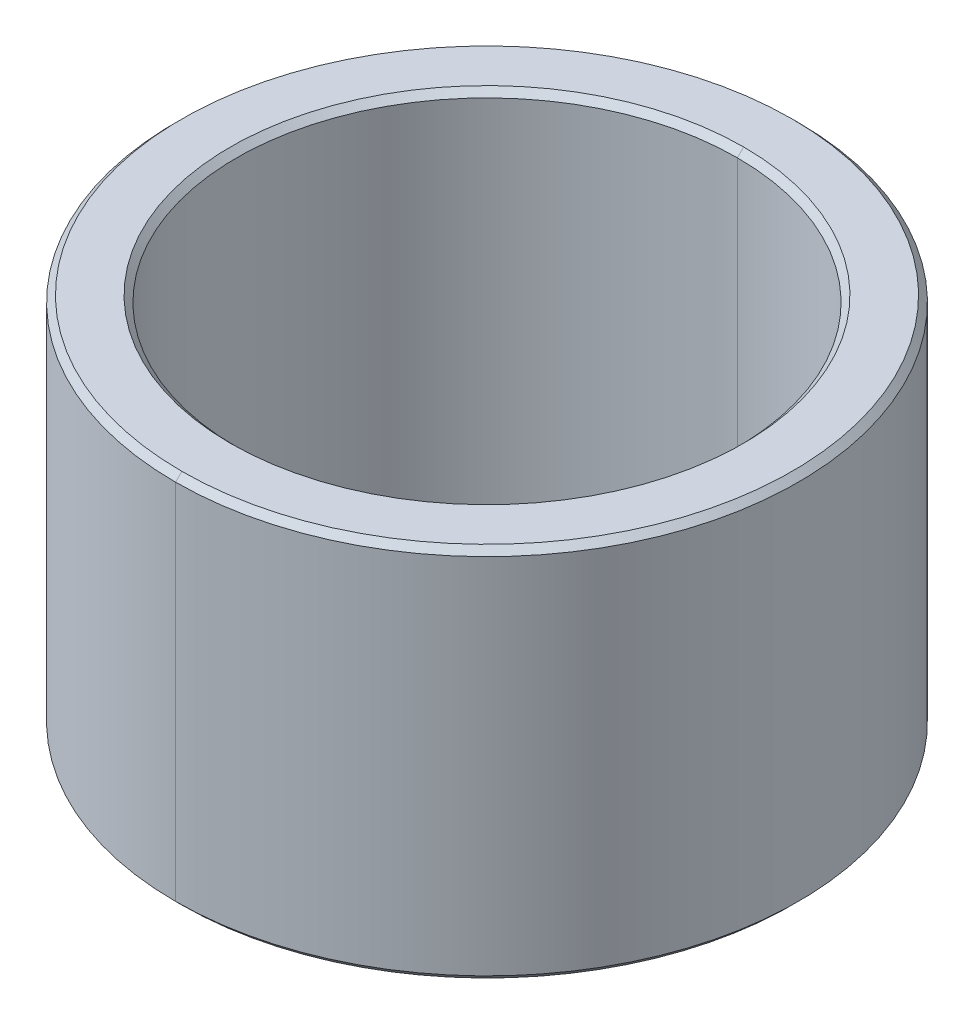
ISO-10303-21;
HEADER;
FILE_DESCRIPTION(('STEP AP214'),'2;1');
FILE_NAME('part.step','',(''),(''),'','','');
FILE_SCHEMA(('AUTOMOTIVE_DESIGN { 1 0 10303 214 1 1 1 1 }'));
ENDSEC;
DATA;
#1=APPLICATION_CONTEXT('core data for automotive mechanical design processes');
#2=APPLICATION_PROTOCOL_DEFINITION('international standard','automotive_design',2000,#1);
#3=PRODUCT_CONTEXT('',#1,'mechanical');
#4=PRODUCT('Part','Part','',(#3));
#5=PRODUCT_RELATED_PRODUCT_CATEGORY('part','',(#4));
#6=PRODUCT_DEFINITION_FORMATION('','',#4);
#7=PRODUCT_DEFINITION_CONTEXT('part definition',#1,'design');
#8=PRODUCT_DEFINITION('design','',#6,#7);
#9=PRODUCT_DEFINITION_SHAPE('','',#8);
#10=(LENGTH_UNIT() NAMED_UNIT(*) SI_UNIT(.MILLI.,.METRE.));
#11=(NAMED_UNIT(*) PLANE_ANGLE_UNIT() SI_UNIT($,.RADIAN.));
#12=(NAMED_UNIT(*) SI_UNIT($,.STERADIAN.) SOLID_ANGLE_UNIT());
#13=UNCERTAINTY_MEASURE_WITH_UNIT(LENGTH_MEASURE(1.E-05),#10,'distance_accuracy_value','');
#14=(GEOMETRIC_REPRESENTATION_CONTEXT(3) GLOBAL_UNCERTAINTY_ASSIGNED_CONTEXT((#13)) GLOBAL_UNIT_ASSIGNED_CONTEXT((#10,
#11,#12)) REPRESENTATION_CONTEXT('',''));
#15=CARTESIAN_POINT('',(0.,0.,0.));
#16=DIRECTION('',(0.,0.,1.));
#17=DIRECTION('',(1.,0.,0.));
#18=AXIS2_PLACEMENT_3D('',#15,#16,#17);
#19=CARTESIAN_POINT('',(0.,2.9,0.));
#20=DIRECTION('',(0.,1.,0.));
#21=DIRECTION('',(0.,0.,1.));
#22=AXIS2_PLACEMENT_3D('',#19,#20,#21);
#23=CONICAL_SURFACE('',#22,4.,0.785398163397452);
#24=DIRECTION('',(0.,0.707106781186544,-0.707106781186551));
#25=VECTOR('',#24,1.);
#26=CARTESIAN_POINT('',(0.,2.9,-4.));
#27=LINE('',#26,#25);
#28=CARTESIAN_POINT('',(0.,2.9,-4.));
#29=VERTEX_POINT('',#28);
#30=CARTESIAN_POINT('',(0.,3.,-4.1));
#31=VERTEX_POINT('',#30);
#32=EDGE_CURVE('E123',#29,#31,#27,.T.);
#33=ORIENTED_EDGE('',*,*,#32,.F.);
#34=CARTESIAN_POINT('',(0.,2.9,0.));
#35=DIRECTION('',(0.,1.,0.));
#36=DIRECTION('',(0.,0.,1.));
#37=AXIS2_PLACEMENT_3D('',#34,#35,#36);
#38=CIRCLE('',#37,4.);
#39=CARTESIAN_POINT('',(0.,2.9,4.));
#40=VERTEX_POINT('',#39);
#41=EDGE_CURVE('E26',#40,#29,#38,.T.);
#42=ORIENTED_EDGE('',*,*,#41,.F.);
#43=DIRECTION('',(0.,0.707106781186544,0.707106781186551));
#44=VECTOR('',#43,1.);
#45=CARTESIAN_POINT('',(0.,2.9,4.));
#46=LINE('',#45,#44);
#47=CARTESIAN_POINT('',(0.,3.,4.1));
#48=VERTEX_POINT('',#47);
#49=EDGE_CURVE('E133',#40,#48,#46,.T.);
#50=ORIENTED_EDGE('',*,*,#49,.T.);
#51=CARTESIAN_POINT('',(0.,3.,0.));
#52=DIRECTION('',(0.,-1.,0.));
#53=DIRECTION('',(0.,0.,1.));
#54=AXIS2_PLACEMENT_3D('',#51,#52,#53);
#55=CIRCLE('',#54,4.1);
#56=EDGE_CURVE('E125',#31,#48,#55,.T.);
#57=ORIENTED_EDGE('',*,*,#56,.F.);
#58=EDGE_LOOP('',(#33,#42,#50,#57));
#59=FACE_BOUND('',#58,.T.);
#60=ADVANCED_FACE('F15',(#59),#23,.F.);
#61=CARTESIAN_POINT('',(0.,-3.,0.));
#62=DIRECTION('',(0.,-1.,0.));
#63=DIRECTION('',(0.,0.,-1.));
#64=AXIS2_PLACEMENT_3D('',#61,#62,#63);
#65=CONICAL_SURFACE('',#64,4.1,0.785398163397452);
#66=DIRECTION('',(0.,-0.707106781186545,0.707106781186551));
#67=VECTOR('',#66,1.);
#68=CARTESIAN_POINT('',(0.,-3.,4.1));
#69=LINE('',#68,#67);
#70=CARTESIAN_POINT('',(0.,-2.9,4.));
#71=VERTEX_POINT('',#70);
#72=CARTESIAN_POINT('',(0.,-3.,4.1));
#73=VERTEX_POINT('',#72);
#74=EDGE_CURVE('E144',#71,#73,#69,.T.);
#75=ORIENTED_EDGE('',*,*,#74,.F.);
#76=CARTESIAN_POINT('',(0.,-2.9,0.));
#77=DIRECTION('',(0.,-1.,0.));
#78=DIRECTION('',(0.,0.,1.));
#79=AXIS2_PLACEMENT_3D('',#76,#77,#78);
#80=CIRCLE('',#79,4.);
#81=CARTESIAN_POINT('',(0.,-2.9,-4.));
#82=VERTEX_POINT('',#81);
#83=EDGE_CURVE('E10',#82,#71,#80,.T.);
#84=ORIENTED_EDGE('',*,*,#83,.F.);
#85=DIRECTION('',(0.,-0.707106781186545,-0.707106781186551));
#86=VECTOR('',#85,1.);
#87=CARTESIAN_POINT('',(0.,-3.,-4.1));
#88=LINE('',#87,#86);
#89=CARTESIAN_POINT('',(0.,-3.,-4.1));
#90=VERTEX_POINT('',#89);
#91=EDGE_CURVE('E143',#82,#90,#88,.T.);
#92=ORIENTED_EDGE('',*,*,#91,.T.);
#93=CARTESIAN_POINT('',(0.,-3.,0.));
#94=DIRECTION('',(0.,1.,0.));
#95=DIRECTION('',(0.,0.,1.));
#96=AXIS2_PLACEMENT_3D('',#93,#94,#95);
#97=CIRCLE('',#96,4.1);
#98=EDGE_CURVE('E186',#73,#90,#97,.T.);
#99=ORIENTED_EDGE('',*,*,#98,.F.);
#100=EDGE_LOOP('',(#75,#84,#92,#99));
#101=FACE_BOUND('',#100,.T.);
#102=ADVANCED_FACE('F262',(#101),#65,.F.);
#103=CARTESIAN_POINT('',(0.,3.,0.));
#104=DIRECTION('',(0.,-1.,0.));
#105=DIRECTION('',(0.,0.,-1.));
#106=AXIS2_PLACEMENT_3D('',#103,#104,#105);
#107=CONICAL_SURFACE('',#106,4.875,0.785398163397452);
#108=DIRECTION('',(0.,-0.707106781186545,0.707106781186551));
#109=VECTOR('',#108,1.);
#110=CARTESIAN_POINT('',(0.,3.,4.875));
#111=LINE('',#110,#109);
#112=CARTESIAN_POINT('',(0.,3.,4.875));
#113=VERTEX_POINT('',#112);
#114=CARTESIAN_POINT('',(0.,2.9,4.975));
#115=VERTEX_POINT('',#114);
#116=EDGE_CURVE('E219',#113,#115,#111,.T.);
#117=ORIENTED_EDGE('',*,*,#116,.F.);
#118=CARTESIAN_POINT('',(0.,3.,0.));
#119=DIRECTION('',(0.,1.,0.));
#120=DIRECTION('',(0.,0.,1.));
#121=AXIS2_PLACEMENT_3D('',#118,#119,#120);
#122=CIRCLE('',#121,4.875);
#123=CARTESIAN_POINT('',(0.,3.,-4.875));
#124=VERTEX_POINT('',#123);
#125=EDGE_CURVE('E148',#124,#113,#122,.T.);
#126=ORIENTED_EDGE('',*,*,#125,.F.);
#127=DIRECTION('',(0.,-0.707106781186545,-0.707106781186551));
#128=VECTOR('',#127,1.);
#129=CARTESIAN_POINT('',(0.,3.,-4.875));
#130=LINE('',#129,#128);
#131=CARTESIAN_POINT('',(0.,2.9,-4.975));
#132=VERTEX_POINT('',#131);
#133=EDGE_CURVE('E154',#124,#132,#130,.T.);
#134=ORIENTED_EDGE('',*,*,#133,.T.);
#135=CARTESIAN_POINT('',(0.,2.9,0.));
#136=DIRECTION('',(0.,-1.,0.));
#137=DIRECTION('',(0.,0.,1.));
#138=AXIS2_PLACEMENT_3D('',#135,#136,#137);
#139=CIRCLE('',#138,4.975);
#140=EDGE_CURVE('E184',#115,#132,#139,.T.);
#141=ORIENTED_EDGE('',*,*,#140,.F.);
#142=EDGE_LOOP('',(#117,#126,#134,#141));
#143=FACE_BOUND('',#142,.T.);
#144=ADVANCED_FACE('F244',(#143),#107,.T.);
#145=CARTESIAN_POINT('',(0.,-2.9,0.));
#146=DIRECTION('',(0.,1.,0.));
#147=DIRECTION('',(0.,0.,1.));
#148=AXIS2_PLACEMENT_3D('',#145,#146,#147);
#149=CONICAL_SURFACE('',#148,4.975,0.785398163397443);
#150=DIRECTION('',(0.,0.707106781186551,-0.707106781186545));
#151=VECTOR('',#150,1.);
#152=CARTESIAN_POINT('',(0.,-2.9,-4.975));
#153=LINE('',#152,#151);
#154=CARTESIAN_POINT('',(0.,-3.,-4.875));
#155=VERTEX_POINT('',#154);
#156=CARTESIAN_POINT('',(0.,-2.9,-4.975));
#157=VERTEX_POINT('',#156);
#158=EDGE_CURVE('E153',#155,#157,#153,.T.);
#159=ORIENTED_EDGE('',*,*,#158,.F.);
#160=CARTESIAN_POINT('',(0.,-3.,0.));
#161=DIRECTION('',(0.,-1.,0.));
#162=DIRECTION('',(0.,0.,1.));
#163=AXIS2_PLACEMENT_3D('',#160,#161,#162);
#164=CIRCLE('',#163,4.875);
#165=CARTESIAN_POINT('',(0.,-3.,4.875));
#166=VERTEX_POINT('',#165);
#167=EDGE_CURVE('E19',#166,#155,#164,.T.);
#168=ORIENTED_EDGE('',*,*,#167,.F.);
#169=DIRECTION('',(0.,0.707106781186551,0.707106781186545));
#170=VECTOR('',#169,1.);
#171=CARTESIAN_POINT('',(0.,-2.9,4.975));
#172=LINE('',#171,#170);
#173=CARTESIAN_POINT('',(0.,-2.9,4.975));
#174=VERTEX_POINT('',#173);
#175=EDGE_CURVE('E157',#166,#174,#172,.T.);
#176=ORIENTED_EDGE('',*,*,#175,.T.);
#177=CARTESIAN_POINT('',(0.,-2.9,0.));
#178=DIRECTION('',(0.,1.,0.));
#179=DIRECTION('',(0.,0.,1.));
#180=AXIS2_PLACEMENT_3D('',#177,#178,#179);
#181=CIRCLE('',#180,4.975);
#182=EDGE_CURVE('E41',#157,#174,#181,.T.);
#183=ORIENTED_EDGE('',*,*,#182,.F.);
#184=EDGE_LOOP('',(#159,#168,#176,#183));
#185=FACE_BOUND('',#184,.T.);
#186=ADVANCED_FACE('F203',(#185),#149,.T.);
#187=CARTESIAN_POINT('',(0.,3.,0.));
#188=DIRECTION('',(0.,-1.,0.));
#189=DIRECTION('',(0.,0.,-1.));
#190=AXIS2_PLACEMENT_3D('',#187,#188,#189);
#191=CYLINDRICAL_SURFACE('',#190,4.);
#192=DIRECTION('',(0.,-1.,0.));
#193=VECTOR('',#192,1.);
#194=CARTESIAN_POINT('',(0.,3.,4.));
#195=LINE('',#194,#193);
#196=EDGE_CURVE('E104',#40,#71,#195,.T.);
#197=ORIENTED_EDGE('',*,*,#196,.F.);
#198=ORIENTED_EDGE('',*,*,#41,.T.);
#199=DIRECTION('',(0.,-1.,0.));
#200=VECTOR('',#199,1.);
#201=CARTESIAN_POINT('',(0.,3.,-4.));
#202=LINE('',#201,#200);
#203=EDGE_CURVE('E101',#29,#82,#202,.T.);
#204=ORIENTED_EDGE('',*,*,#203,.T.);
#205=ORIENTED_EDGE('',*,*,#83,.T.);
#206=EDGE_LOOP('',(#197,#198,#204,#205));
#207=FACE_BOUND('',#206,.T.);
#208=ADVANCED_FACE('F17',(#207),#191,.F.);
#209=CARTESIAN_POINT('',(0.,3.,0.));
#210=DIRECTION('',(0.,-1.,0.));
#211=DIRECTION('',(0.,0.,-1.));
#212=AXIS2_PLACEMENT_3D('',#209,#210,#211);
#213=CYLINDRICAL_SURFACE('',#212,4.975);
#214=DIRECTION('',(0.,-1.,0.));
#215=VECTOR('',#214,1.);
#216=CARTESIAN_POINT('',(0.,3.,4.975));
#217=LINE('',#216,#215);
#218=EDGE_CURVE('E120',#115,#174,#217,.T.);
#219=ORIENTED_EDGE('',*,*,#218,.F.);
#220=ORIENTED_EDGE('',*,*,#140,.T.);
#221=DIRECTION('',(0.,-1.,0.));
#222=VECTOR('',#221,1.);
#223=CARTESIAN_POINT('',(0.,3.,-4.975));
#224=LINE('',#223,#222);
#225=EDGE_CURVE('E181',#132,#157,#224,.T.);
#226=ORIENTED_EDGE('',*,*,#225,.T.);
#227=ORIENTED_EDGE('',*,*,#182,.T.);
#228=EDGE_LOOP('',(#219,#220,#226,#227));
#229=FACE_BOUND('',#228,.T.);
#230=ADVANCED_FACE('F246',(#229),#213,.T.);
#231=CARTESIAN_POINT('',(0.,-3.,0.));
#232=DIRECTION('',(0.,1.,0.));
#233=DIRECTION('',(1.,0.,0.));
#234=AXIS2_PLACEMENT_3D('',#231,#232,#233);
#235=PLANE('',#234);
#236=CARTESIAN_POINT('',(0.,-3.,0.));
#237=DIRECTION('',(0.,1.,0.));
#238=DIRECTION('',(0.,0.,1.));
#239=AXIS2_PLACEMENT_3D('',#236,#237,#238);
#240=CIRCLE('',#239,4.1);
#241=EDGE_CURVE('E140',#90,#73,#240,.T.);
#242=ORIENTED_EDGE('',*,*,#241,.T.);
#243=ORIENTED_EDGE('',*,*,#98,.T.);
#244=EDGE_LOOP('',(#242,#243));
#245=FACE_BOUND('',#244,.T.);
#246=ORIENTED_EDGE('',*,*,#167,.T.);
#247=CARTESIAN_POINT('',(0.,-3.,0.));
#248=DIRECTION('',(0.,-1.,0.));
#249=DIRECTION('',(0.,0.,1.));
#250=AXIS2_PLACEMENT_3D('',#247,#248,#249);
#251=CIRCLE('',#250,4.875);
#252=EDGE_CURVE('E149',#155,#166,#251,.T.);
#253=ORIENTED_EDGE('',*,*,#252,.T.);
#254=EDGE_LOOP('',(#246,#253));
#255=FACE_BOUND('',#254,.T.);
#256=ADVANCED_FACE('F197',(#245,#255),#235,.F.);
#257=CARTESIAN_POINT('',(0.,3.,0.));
#258=DIRECTION('',(0.,1.,0.));
#259=DIRECTION('',(1.,0.,0.));
#260=AXIS2_PLACEMENT_3D('',#257,#258,#259);
#261=PLANE('',#260);
#262=CARTESIAN_POINT('',(0.,3.,0.));
#263=DIRECTION('',(0.,-1.,0.));
#264=DIRECTION('',(0.,0.,1.));
#265=AXIS2_PLACEMENT_3D('',#262,#263,#264);
#266=CIRCLE('',#265,4.1);
#267=EDGE_CURVE('E130',#48,#31,#266,.T.);
#268=ORIENTED_EDGE('',*,*,#267,.T.);
#269=ORIENTED_EDGE('',*,*,#56,.T.);
#270=EDGE_LOOP('',(#268,#269));
#271=FACE_BOUND('',#270,.T.);
#272=ORIENTED_EDGE('',*,*,#125,.T.);
#273=CARTESIAN_POINT('',(0.,3.,0.));
#274=DIRECTION('',(0.,1.,0.));
#275=DIRECTION('',(0.,0.,1.));
#276=AXIS2_PLACEMENT_3D('',#273,#274,#275);
#277=CIRCLE('',#276,4.875);
#278=EDGE_CURVE('E222',#113,#124,#277,.T.);
#279=ORIENTED_EDGE('',*,*,#278,.T.);
#280=EDGE_LOOP('',(#272,#279));
#281=FACE_BOUND('',#280,.T.);
#282=ADVANCED_FACE('F237',(#271,#281),#261,.T.);
#283=CARTESIAN_POINT('',(0.,3.,0.));
#284=DIRECTION('',(0.,-1.,0.));
#285=DIRECTION('',(0.,0.,-1.));
#286=AXIS2_PLACEMENT_3D('',#283,#284,#285);
#287=CYLINDRICAL_SURFACE('',#286,4.975);
#288=CARTESIAN_POINT('',(0.,2.9,0.));
#289=DIRECTION('',(0.,-1.,0.));
#290=DIRECTION('',(0.,0.,1.));
#291=AXIS2_PLACEMENT_3D('',#288,#289,#290);
#292=CIRCLE('',#291,4.975);
#293=EDGE_CURVE('E178',#132,#115,#292,.T.);
#294=ORIENTED_EDGE('',*,*,#293,.T.);
#295=ORIENTED_EDGE('',*,*,#218,.T.);
#296=CARTESIAN_POINT('',(0.,-2.9,0.));
#297=DIRECTION('',(0.,1.,0.));
#298=DIRECTION('',(0.,0.,1.));
#299=AXIS2_PLACEMENT_3D('',#296,#297,#298);
#300=CIRCLE('',#299,4.975);
#301=EDGE_CURVE('E207',#174,#157,#300,.T.);
#302=ORIENTED_EDGE('',*,*,#301,.T.);
#303=ORIENTED_EDGE('',*,*,#225,.F.);
#304=EDGE_LOOP('',(#294,#295,#302,#303));
#305=FACE_BOUND('',#304,.T.);
#306=ADVANCED_FACE('F248',(#305),#287,.T.);
#307=CARTESIAN_POINT('',(0.,3.,0.));
#308=DIRECTION('',(0.,-1.,0.));
#309=DIRECTION('',(0.,0.,-1.));
#310=AXIS2_PLACEMENT_3D('',#307,#308,#309);
#311=CYLINDRICAL_SURFACE('',#310,4.);
#312=CARTESIAN_POINT('',(0.,2.9,0.));
#313=DIRECTION('',(0.,1.,0.));
#314=DIRECTION('',(0.,0.,1.));
#315=AXIS2_PLACEMENT_3D('',#312,#313,#314);
#316=CIRCLE('',#315,4.);
#317=EDGE_CURVE('E116',#29,#40,#316,.T.);
#318=ORIENTED_EDGE('',*,*,#317,.T.);
#319=ORIENTED_EDGE('',*,*,#196,.T.);
#320=CARTESIAN_POINT('',(0.,-2.9,0.));
#321=DIRECTION('',(0.,-1.,0.));
#322=DIRECTION('',(0.,0.,1.));
#323=AXIS2_PLACEMENT_3D('',#320,#321,#322);
#324=CIRCLE('',#323,4.);
#325=EDGE_CURVE('E118',#71,#82,#324,.T.);
#326=ORIENTED_EDGE('',*,*,#325,.T.);
#327=ORIENTED_EDGE('',*,*,#203,.F.);
#328=EDGE_LOOP('',(#318,#319,#326,#327));
#329=FACE_BOUND('',#328,.T.);
#330=ADVANCED_FACE('F114',(#329),#311,.F.);
#331=CARTESIAN_POINT('',(0.,-2.9,0.));
#332=DIRECTION('',(0.,1.,0.));
#333=DIRECTION('',(0.,0.,1.));
#334=AXIS2_PLACEMENT_3D('',#331,#332,#333);
#335=CONICAL_SURFACE('',#334,4.975,0.785398163397443);
#336=ORIENTED_EDGE('',*,*,#252,.F.);
#337=ORIENTED_EDGE('',*,*,#158,.T.);
#338=ORIENTED_EDGE('',*,*,#301,.F.);
#339=ORIENTED_EDGE('',*,*,#175,.F.);
#340=EDGE_LOOP('',(#336,#337,#338,#339));
#341=FACE_BOUND('',#340,.T.);
#342=ADVANCED_FACE('F209',(#341),#335,.T.);
#343=CARTESIAN_POINT('',(0.,3.,0.));
#344=DIRECTION('',(0.,-1.,0.));
#345=DIRECTION('',(0.,0.,-1.));
#346=AXIS2_PLACEMENT_3D('',#343,#344,#345);
#347=CONICAL_SURFACE('',#346,4.875,0.785398163397452);
#348=ORIENTED_EDGE('',*,*,#278,.F.);
#349=ORIENTED_EDGE('',*,*,#116,.T.);
#350=ORIENTED_EDGE('',*,*,#293,.F.);
#351=ORIENTED_EDGE('',*,*,#133,.F.);
#352=EDGE_LOOP('',(#348,#349,#350,#351));
#353=FACE_BOUND('',#352,.T.);
#354=ADVANCED_FACE('F241',(#353),#347,.T.);
#355=CARTESIAN_POINT('',(0.,-3.,0.));
#356=DIRECTION('',(0.,-1.,0.));
#357=DIRECTION('',(0.,0.,-1.));
#358=AXIS2_PLACEMENT_3D('',#355,#356,#357);
#359=CONICAL_SURFACE('',#358,4.1,0.785398163397452);
#360=ORIENTED_EDGE('',*,*,#325,.F.);
#361=ORIENTED_EDGE('',*,*,#74,.T.);
#362=ORIENTED_EDGE('',*,*,#241,.F.);
#363=ORIENTED_EDGE('',*,*,#91,.F.);
#364=EDGE_LOOP('',(#360,#361,#362,#363));
#365=FACE_BOUND('',#364,.T.);
#366=ADVANCED_FACE('F274',(#365),#359,.F.);
#367=CARTESIAN_POINT('',(0.,2.9,0.));
#368=DIRECTION('',(0.,1.,0.));
#369=DIRECTION('',(0.,0.,1.));
#370=AXIS2_PLACEMENT_3D('',#367,#368,#369);
#371=CONICAL_SURFACE('',#370,4.,0.785398163397452);
#372=ORIENTED_EDGE('',*,*,#317,.F.);
#373=ORIENTED_EDGE('',*,*,#32,.T.);
#374=ORIENTED_EDGE('',*,*,#267,.F.);
#375=ORIENTED_EDGE('',*,*,#49,.F.);
#376=EDGE_LOOP('',(#372,#373,#374,#375));
#377=FACE_BOUND('',#376,.T.);
#378=ADVANCED_FACE('F132',(#377),#371,.F.);
#379=CLOSED_SHELL('',(#60,#102,#144,#186,#208,#230,#256,#282,#306,#330,#342,#354,#366,#378));
#380=MANIFOLD_SOLID_BREP('B1',#379);
#381=ADVANCED_BREP_SHAPE_REPRESENTATION('',(#18,#380),#14);
#382=SHAPE_DEFINITION_REPRESENTATION(#9,#381);
ENDSEC;
END-ISO-10303-21;
